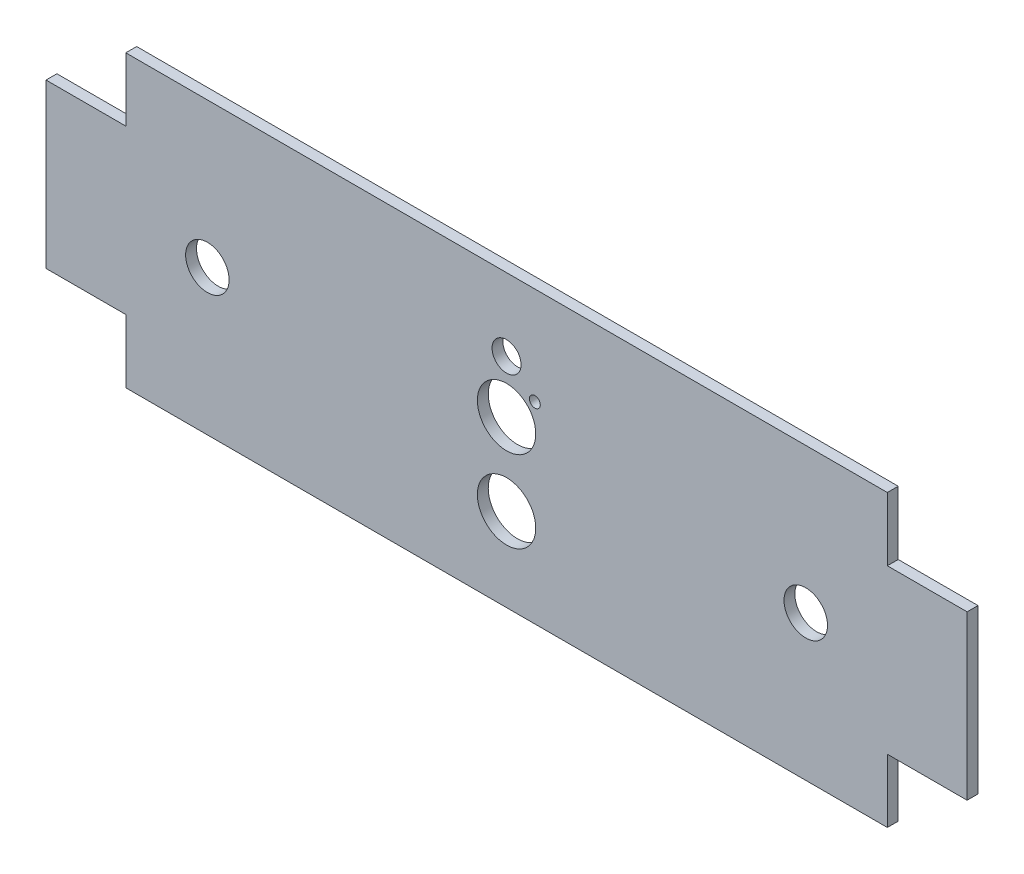
ISO-10303-21;
HEADER;
FILE_DESCRIPTION(('STEP AP214'),'2;1');
FILE_NAME('part.step','',(''),(''),'','','');
FILE_SCHEMA(('AUTOMOTIVE_DESIGN { 1 0 10303 214 1 1 1 1 }'));
ENDSEC;
DATA;
#1=APPLICATION_CONTEXT('core data for automotive mechanical design processes');
#2=APPLICATION_PROTOCOL_DEFINITION('international standard','automotive_design',2000,#1);
#3=PRODUCT_CONTEXT('',#1,'mechanical');
#4=PRODUCT('Part','Part','',(#3));
#5=PRODUCT_RELATED_PRODUCT_CATEGORY('part','',(#4));
#6=PRODUCT_DEFINITION_FORMATION('','',#4);
#7=PRODUCT_DEFINITION_CONTEXT('part definition',#1,'design');
#8=PRODUCT_DEFINITION('design','',#6,#7);
#9=PRODUCT_DEFINITION_SHAPE('','',#8);
#10=(LENGTH_UNIT() NAMED_UNIT(*) SI_UNIT(.MILLI.,.METRE.));
#11=(NAMED_UNIT(*) PLANE_ANGLE_UNIT() SI_UNIT($,.RADIAN.));
#12=(NAMED_UNIT(*) SI_UNIT($,.STERADIAN.) SOLID_ANGLE_UNIT());
#13=UNCERTAINTY_MEASURE_WITH_UNIT(LENGTH_MEASURE(1.E-05),#10,'distance_accuracy_value','');
#14=(GEOMETRIC_REPRESENTATION_CONTEXT(3) GLOBAL_UNCERTAINTY_ASSIGNED_CONTEXT((#13)) GLOBAL_UNIT_ASSIGNED_CONTEXT((#10,
#11,#12)) REPRESENTATION_CONTEXT('',''));
#15=CARTESIAN_POINT('',(0.,0.,0.));
#16=DIRECTION('',(0.,0.,1.));
#17=DIRECTION('',(1.,0.,0.));
#18=AXIS2_PLACEMENT_3D('',#15,#16,#17);
#19=CARTESIAN_POINT('',(-105.,-203.144327739373,3.));
#20=DIRECTION('',(-1.,0.,0.));
#21=DIRECTION('',(0.,0.,1.));
#22=AXIS2_PLACEMENT_3D('',#19,#20,#21);
#23=PLANE('',#22);
#24=DIRECTION('',(0.,1.,0.));
#25=VECTOR('',#24,1.);
#26=CARTESIAN_POINT('',(-105.,-203.144327739373,0.));
#27=LINE('',#26,#25);
#28=CARTESIAN_POINT('',(-105.,22.5,0.));
#29=VERTEX_POINT('',#28);
#30=CARTESIAN_POINT('',(-105.,40.,0.));
#31=VERTEX_POINT('',#30);
#32=EDGE_CURVE('E176',#29,#31,#27,.T.);
#33=ORIENTED_EDGE('',*,*,#32,.F.);
#34=DIRECTION('',(0.,0.,-1.));
#35=VECTOR('',#34,1.);
#36=CARTESIAN_POINT('',(-105.,22.5,3.));
#37=LINE('',#36,#35);
#38=CARTESIAN_POINT('',(-105.,22.5,3.));
#39=VERTEX_POINT('',#38);
#40=EDGE_CURVE('E189',#39,#29,#37,.T.);
#41=ORIENTED_EDGE('',*,*,#40,.F.);
#42=DIRECTION('',(0.,1.,0.));
#43=VECTOR('',#42,1.);
#44=CARTESIAN_POINT('',(-105.,-203.144327739373,3.));
#45=LINE('',#44,#43);
#46=CARTESIAN_POINT('',(-105.,40.,3.));
#47=VERTEX_POINT('',#46);
#48=EDGE_CURVE('E193',#39,#47,#45,.T.);
#49=ORIENTED_EDGE('',*,*,#48,.T.);
#50=DIRECTION('',(0.,0.,1.));
#51=VECTOR('',#50,1.);
#52=CARTESIAN_POINT('',(-105.,40.,-210.237960416286));
#53=LINE('',#52,#51);
#54=EDGE_CURVE('E265',#31,#47,#53,.T.);
#55=ORIENTED_EDGE('',*,*,#54,.F.);
#56=EDGE_LOOP('',(#33,#41,#49,#55));
#57=FACE_BOUND('',#56,.T.);
#58=ADVANCED_FACE('F69',(#57),#23,.T.);
#59=CARTESIAN_POINT('',(-105.,-40.,0.));
#60=VERTEX_POINT('',#59);
#61=CARTESIAN_POINT('',(-105.,-22.5,0.));
#62=VERTEX_POINT('',#61);
#63=EDGE_CURVE('E116',#60,#62,#27,.T.);
#64=ORIENTED_EDGE('',*,*,#63,.F.);
#65=DIRECTION('',(0.,0.,1.));
#66=VECTOR('',#65,1.);
#67=CARTESIAN_POINT('',(-105.,-40.,-210.237960416286));
#68=LINE('',#67,#66);
#69=CARTESIAN_POINT('',(-105.,-40.,3.));
#70=VERTEX_POINT('',#69);
#71=EDGE_CURVE('E274',#60,#70,#68,.T.);
#72=ORIENTED_EDGE('',*,*,#71,.T.);
#73=CARTESIAN_POINT('',(-105.,-22.5,3.));
#74=VERTEX_POINT('',#73);
#75=EDGE_CURVE('E217',#70,#74,#45,.T.);
#76=ORIENTED_EDGE('',*,*,#75,.T.);
#77=DIRECTION('',(0.,0.,-1.));
#78=VECTOR('',#77,1.);
#79=CARTESIAN_POINT('',(-105.,-22.5,3.));
#80=LINE('',#79,#78);
#81=EDGE_CURVE('E192',#74,#62,#80,.T.);
#82=ORIENTED_EDGE('',*,*,#81,.T.);
#83=EDGE_LOOP('',(#64,#72,#76,#82));
#84=FACE_BOUND('',#83,.T.);
#85=ADVANCED_FACE('F340',(#84),#23,.T.);
#86=CARTESIAN_POINT('',(0.,-22.5,3.));
#87=DIRECTION('',(0.,1.,0.));
#88=DIRECTION('',(0.,0.,1.));
#89=AXIS2_PLACEMENT_3D('',#86,#87,#88);
#90=PLANE('',#89);
#91=DIRECTION('',(1.,0.,0.));
#92=VECTOR('',#91,1.);
#93=CARTESIAN_POINT('',(0.,-22.5,0.));
#94=LINE('',#93,#92);
#95=CARTESIAN_POINT('',(-127.,-22.5,0.));
#96=VERTEX_POINT('',#95);
#97=EDGE_CURVE('E178',#96,#62,#94,.T.);
#98=ORIENTED_EDGE('',*,*,#97,.T.);
#99=ORIENTED_EDGE('',*,*,#81,.F.);
#100=DIRECTION('',(1.,0.,0.));
#101=VECTOR('',#100,1.);
#102=CARTESIAN_POINT('',(0.,-22.5,3.));
#103=LINE('',#102,#101);
#104=CARTESIAN_POINT('',(-127.,-22.5,3.));
#105=VERTEX_POINT('',#104);
#106=EDGE_CURVE('E300',#105,#74,#103,.T.);
#107=ORIENTED_EDGE('',*,*,#106,.F.);
#108=DIRECTION('',(0.,0.,-1.));
#109=VECTOR('',#108,1.);
#110=CARTESIAN_POINT('',(-127.,-22.5,3.));
#111=LINE('',#110,#109);
#112=EDGE_CURVE('E195',#105,#96,#111,.T.);
#113=ORIENTED_EDGE('',*,*,#112,.T.);
#114=EDGE_LOOP('',(#98,#99,#107,#113));
#115=FACE_BOUND('',#114,.T.);
#116=ADVANCED_FACE('F342',(#115),#90,.F.);
#117=CARTESIAN_POINT('',(-127.,-203.144327739373,3.));
#118=DIRECTION('',(-1.,0.,0.));
#119=DIRECTION('',(0.,0.,1.));
#120=AXIS2_PLACEMENT_3D('',#117,#118,#119);
#121=PLANE('',#120);
#122=DIRECTION('',(0.,1.,0.));
#123=VECTOR('',#122,1.);
#124=CARTESIAN_POINT('',(-127.,-203.144327739373,0.));
#125=LINE('',#124,#123);
#126=CARTESIAN_POINT('',(-127.,22.5,0.));
#127=VERTEX_POINT('',#126);
#128=EDGE_CURVE('E202',#96,#127,#125,.T.);
#129=ORIENTED_EDGE('',*,*,#128,.F.);
#130=ORIENTED_EDGE('',*,*,#112,.F.);
#131=DIRECTION('',(0.,1.,0.));
#132=VECTOR('',#131,1.);
#133=CARTESIAN_POINT('',(-127.,-203.144327739373,3.));
#134=LINE('',#133,#132);
#135=CARTESIAN_POINT('',(-127.,22.5,3.));
#136=VERTEX_POINT('',#135);
#137=EDGE_CURVE('E204',#105,#136,#134,.T.);
#138=ORIENTED_EDGE('',*,*,#137,.T.);
#139=DIRECTION('',(0.,0.,-1.));
#140=VECTOR('',#139,1.);
#141=CARTESIAN_POINT('',(-127.,22.5,3.));
#142=LINE('',#141,#140);
#143=EDGE_CURVE('E157',#136,#127,#142,.T.);
#144=ORIENTED_EDGE('',*,*,#143,.T.);
#145=EDGE_LOOP('',(#129,#130,#138,#144));
#146=FACE_BOUND('',#145,.T.);
#147=ADVANCED_FACE('F200',(#146),#121,.T.);
#148=CARTESIAN_POINT('',(0.,22.5,3.));
#149=DIRECTION('',(0.,1.,0.));
#150=DIRECTION('',(0.,0.,1.));
#151=AXIS2_PLACEMENT_3D('',#148,#149,#150);
#152=PLANE('',#151);
#153=DIRECTION('',(1.,0.,0.));
#154=VECTOR('',#153,1.);
#155=CARTESIAN_POINT('',(0.,22.5,0.));
#156=LINE('',#155,#154);
#157=EDGE_CURVE('E208',#127,#29,#156,.T.);
#158=ORIENTED_EDGE('',*,*,#157,.F.);
#159=ORIENTED_EDGE('',*,*,#143,.F.);
#160=DIRECTION('',(1.,0.,0.));
#161=VECTOR('',#160,1.);
#162=CARTESIAN_POINT('',(0.,22.5,3.));
#163=LINE('',#162,#161);
#164=EDGE_CURVE('E298',#136,#39,#163,.T.);
#165=ORIENTED_EDGE('',*,*,#164,.T.);
#166=ORIENTED_EDGE('',*,*,#40,.T.);
#167=EDGE_LOOP('',(#158,#159,#165,#166));
#168=FACE_BOUND('',#167,.T.);
#169=ADVANCED_FACE('F209',(#168),#152,.T.);
#170=CARTESIAN_POINT('',(0.,-203.144327739373,0.));
#171=DIRECTION('',(0.,0.,1.));
#172=DIRECTION('',(1.,0.,0.));
#173=AXIS2_PLACEMENT_3D('',#170,#171,#172);
#174=PLANE('',#173);
#175=CARTESIAN_POINT('',(0.,-17.,0.));
#176=DIRECTION('',(0.,0.,-1.));
#177=DIRECTION('',(-1.,0.,0.));
#178=AXIS2_PLACEMENT_3D('',#175,#176,#177);
#179=CIRCLE('',#178,8.05);
#180=CARTESIAN_POINT('',(-8.05000000000001,-17.,0.));
#181=VERTEX_POINT('',#180);
#182=EDGE_CURVE('E260',#181,#181,#179,.T.);
#183=ORIENTED_EDGE('',*,*,#182,.F.);
#184=EDGE_LOOP('',(#183));
#185=FACE_BOUND('',#184,.T.);
#186=CARTESIAN_POINT('',(0.,5.5,0.));
#187=DIRECTION('',(0.,0.,-1.));
#188=DIRECTION('',(-1.,0.,0.));
#189=AXIS2_PLACEMENT_3D('',#186,#187,#188);
#190=CIRCLE('',#189,8.05);
#191=CARTESIAN_POINT('',(-8.05,5.5,0.));
#192=VERTEX_POINT('',#191);
#193=EDGE_CURVE('E250',#192,#192,#190,.T.);
#194=ORIENTED_EDGE('',*,*,#193,.F.);
#195=EDGE_LOOP('',(#194));
#196=FACE_BOUND('',#195,.T.);
#197=CARTESIAN_POINT('',(7.8,13.05,0.));
#198=DIRECTION('',(0.,0.,-1.));
#199=DIRECTION('',(-1.,0.,0.));
#200=AXIS2_PLACEMENT_3D('',#197,#198,#199);
#201=CIRCLE('',#200,1.5);
#202=CARTESIAN_POINT('',(6.29999999999999,13.05,0.));
#203=VERTEX_POINT('',#202);
#204=EDGE_CURVE('E247',#203,#203,#201,.T.);
#205=ORIENTED_EDGE('',*,*,#204,.F.);
#206=EDGE_LOOP('',(#205));
#207=FACE_BOUND('',#206,.T.);
#208=CARTESIAN_POINT('',(0.,20.,0.));
#209=DIRECTION('',(0.,0.,1.));
#210=DIRECTION('',(1.,0.,0.));
#211=AXIS2_PLACEMENT_3D('',#208,#209,#210);
#212=CIRCLE('',#211,4.);
#213=CARTESIAN_POINT('',(4.,20.,0.));
#214=VERTEX_POINT('',#213);
#215=EDGE_CURVE('E284',#214,#214,#212,.F.);
#216=ORIENTED_EDGE('',*,*,#215,.F.);
#217=EDGE_LOOP('',(#216));
#218=FACE_BOUND('',#217,.T.);
#219=CARTESIAN_POINT('',(-82.5,0.,0.));
#220=DIRECTION('',(0.,0.,1.));
#221=DIRECTION('',(1.,0.,0.));
#222=AXIS2_PLACEMENT_3D('',#219,#220,#221);
#223=CIRCLE('',#222,6.);
#224=CARTESIAN_POINT('',(-76.5,0.,0.));
#225=VERTEX_POINT('',#224);
#226=EDGE_CURVE('E290',#225,#225,#223,.F.);
#227=ORIENTED_EDGE('',*,*,#226,.F.);
#228=EDGE_LOOP('',(#227));
#229=FACE_BOUND('',#228,.T.);
#230=CARTESIAN_POINT('',(82.5,0.,0.));
#231=DIRECTION('',(0.,0.,1.));
#232=DIRECTION('',(1.,0.,0.));
#233=AXIS2_PLACEMENT_3D('',#230,#231,#232);
#234=CIRCLE('',#233,6.);
#235=CARTESIAN_POINT('',(88.5,0.,0.));
#236=VERTEX_POINT('',#235);
#237=EDGE_CURVE('E165',#236,#236,#234,.F.);
#238=ORIENTED_EDGE('',*,*,#237,.F.);
#239=EDGE_LOOP('',(#238));
#240=FACE_BOUND('',#239,.T.);
#241=ORIENTED_EDGE('',*,*,#157,.T.);
#242=ORIENTED_EDGE('',*,*,#32,.T.);
#243=DIRECTION('',(1.,0.,0.));
#244=VECTOR('',#243,1.);
#245=CARTESIAN_POINT('',(-105.,40.,0.));
#246=LINE('',#245,#244);
#247=CARTESIAN_POINT('',(105.,40.,0.));
#248=VERTEX_POINT('',#247);
#249=EDGE_CURVE('E171',#31,#248,#246,.T.);
#250=ORIENTED_EDGE('',*,*,#249,.T.);
#251=DIRECTION('',(0.,1.,0.));
#252=VECTOR('',#251,1.);
#253=CARTESIAN_POINT('',(105.,-203.144327739373,0.));
#254=LINE('',#253,#252);
#255=CARTESIAN_POINT('',(105.,22.5,0.));
#256=VERTEX_POINT('',#255);
#257=EDGE_CURVE('E153',#256,#248,#254,.T.);
#258=ORIENTED_EDGE('',*,*,#257,.F.);
#259=DIRECTION('',(-1.,0.,0.));
#260=VECTOR('',#259,1.);
#261=CARTESIAN_POINT('',(127.,22.5,0.));
#262=LINE('',#261,#260);
#263=CARTESIAN_POINT('',(127.,22.5,0.));
#264=VERTEX_POINT('',#263);
#265=EDGE_CURVE('E160',#264,#256,#262,.T.);
#266=ORIENTED_EDGE('',*,*,#265,.F.);
#267=DIRECTION('',(0.,-1.,0.));
#268=VECTOR('',#267,1.);
#269=CARTESIAN_POINT('',(127.,22.5,0.));
#270=LINE('',#269,#268);
#271=CARTESIAN_POINT('',(127.,-22.5,0.));
#272=VERTEX_POINT('',#271);
#273=EDGE_CURVE('E230',#264,#272,#270,.T.);
#274=ORIENTED_EDGE('',*,*,#273,.T.);
#275=DIRECTION('',(-1.,0.,0.));
#276=VECTOR('',#275,1.);
#277=CARTESIAN_POINT('',(127.,-22.5,0.));
#278=LINE('',#277,#276);
#279=CARTESIAN_POINT('',(105.,-22.5,0.));
#280=VERTEX_POINT('',#279);
#281=EDGE_CURVE('E164',#272,#280,#278,.T.);
#282=ORIENTED_EDGE('',*,*,#281,.T.);
#283=CARTESIAN_POINT('',(105.,-40.,0.));
#284=VERTEX_POINT('',#283);
#285=EDGE_CURVE('E173',#284,#280,#254,.T.);
#286=ORIENTED_EDGE('',*,*,#285,.F.);
#287=DIRECTION('',(-1.,0.,0.));
#288=VECTOR('',#287,1.);
#289=CARTESIAN_POINT('',(-105.,-40.,0.));
#290=LINE('',#289,#288);
#291=EDGE_CURVE('E278',#284,#60,#290,.T.);
#292=ORIENTED_EDGE('',*,*,#291,.T.);
#293=ORIENTED_EDGE('',*,*,#63,.T.);
#294=ORIENTED_EDGE('',*,*,#97,.F.);
#295=ORIENTED_EDGE('',*,*,#128,.T.);
#296=EDGE_LOOP('',(#241,#242,#250,#258,#266,#274,#282,#286,#292,#293,#294,#295));
#297=FACE_BOUND('',#296,.T.);
#298=ADVANCED_FACE('F168',(#185,#196,#207,#218,#229,#240,#297),#174,.F.);
#299=CARTESIAN_POINT('',(0.,-203.144327739373,3.));
#300=DIRECTION('',(0.,0.,1.));
#301=DIRECTION('',(1.,0.,0.));
#302=AXIS2_PLACEMENT_3D('',#299,#300,#301);
#303=PLANE('',#302);
#304=CARTESIAN_POINT('',(0.,-17.,3.));
#305=DIRECTION('',(0.,0.,1.));
#306=DIRECTION('',(1.,0.,0.));
#307=AXIS2_PLACEMENT_3D('',#304,#305,#306);
#308=CIRCLE('',#307,8.05);
#309=CARTESIAN_POINT('',(8.05,-17.,3.));
#310=VERTEX_POINT('',#309);
#311=EDGE_CURVE('E73',#310,#310,#308,.T.);
#312=ORIENTED_EDGE('',*,*,#311,.F.);
#313=EDGE_LOOP('',(#312));
#314=FACE_BOUND('',#313,.T.);
#315=CARTESIAN_POINT('',(0.,5.5,3.));
#316=DIRECTION('',(0.,0.,1.));
#317=DIRECTION('',(1.,0.,0.));
#318=AXIS2_PLACEMENT_3D('',#315,#316,#317);
#319=CIRCLE('',#318,8.05);
#320=CARTESIAN_POINT('',(8.05,5.5,3.));
#321=VERTEX_POINT('',#320);
#322=EDGE_CURVE('E248',#321,#321,#319,.T.);
#323=ORIENTED_EDGE('',*,*,#322,.F.);
#324=EDGE_LOOP('',(#323));
#325=FACE_BOUND('',#324,.T.);
#326=CARTESIAN_POINT('',(7.8,13.05,3.));
#327=DIRECTION('',(0.,0.,1.));
#328=DIRECTION('',(1.,0.,0.));
#329=AXIS2_PLACEMENT_3D('',#326,#327,#328);
#330=CIRCLE('',#329,1.5);
#331=CARTESIAN_POINT('',(9.3,13.05,3.));
#332=VERTEX_POINT('',#331);
#333=EDGE_CURVE('E244',#332,#332,#330,.T.);
#334=ORIENTED_EDGE('',*,*,#333,.F.);
#335=EDGE_LOOP('',(#334));
#336=FACE_BOUND('',#335,.T.);
#337=CARTESIAN_POINT('',(0.,20.,3.));
#338=DIRECTION('',(0.,0.,1.));
#339=DIRECTION('',(1.,0.,0.));
#340=AXIS2_PLACEMENT_3D('',#337,#338,#339);
#341=CIRCLE('',#340,4.);
#342=CARTESIAN_POINT('',(4.,20.,3.));
#343=VERTEX_POINT('',#342);
#344=EDGE_CURVE('E281',#343,#343,#341,.T.);
#345=ORIENTED_EDGE('',*,*,#344,.F.);
#346=EDGE_LOOP('',(#345));
#347=FACE_BOUND('',#346,.T.);
#348=CARTESIAN_POINT('',(-82.5,0.,3.));
#349=DIRECTION('',(0.,0.,1.));
#350=DIRECTION('',(1.,0.,0.));
#351=AXIS2_PLACEMENT_3D('',#348,#349,#350);
#352=CIRCLE('',#351,6.);
#353=CARTESIAN_POINT('',(-76.5,0.,3.));
#354=VERTEX_POINT('',#353);
#355=EDGE_CURVE('E287',#354,#354,#352,.T.);
#356=ORIENTED_EDGE('',*,*,#355,.F.);
#357=EDGE_LOOP('',(#356));
#358=FACE_BOUND('',#357,.T.);
#359=CARTESIAN_POINT('',(82.5,0.,3.));
#360=DIRECTION('',(0.,0.,1.));
#361=DIRECTION('',(1.,0.,0.));
#362=AXIS2_PLACEMENT_3D('',#359,#360,#361);
#363=CIRCLE('',#362,6.);
#364=CARTESIAN_POINT('',(88.5,0.,3.));
#365=VERTEX_POINT('',#364);
#366=EDGE_CURVE('E293',#365,#365,#363,.T.);
#367=ORIENTED_EDGE('',*,*,#366,.F.);
#368=EDGE_LOOP('',(#367));
#369=FACE_BOUND('',#368,.T.);
#370=ORIENTED_EDGE('',*,*,#164,.F.);
#371=ORIENTED_EDGE('',*,*,#137,.F.);
#372=ORIENTED_EDGE('',*,*,#106,.T.);
#373=ORIENTED_EDGE('',*,*,#75,.F.);
#374=DIRECTION('',(1.,0.,0.));
#375=VECTOR('',#374,1.);
#376=CARTESIAN_POINT('',(-105.,-40.,3.));
#377=LINE('',#376,#375);
#378=CARTESIAN_POINT('',(105.,-40.,3.));
#379=VERTEX_POINT('',#378);
#380=EDGE_CURVE('E264',#70,#379,#377,.T.);
#381=ORIENTED_EDGE('',*,*,#380,.T.);
#382=DIRECTION('',(0.,1.,0.));
#383=VECTOR('',#382,1.);
#384=CARTESIAN_POINT('',(105.,-203.144327739373,3.));
#385=LINE('',#384,#383);
#386=CARTESIAN_POINT('',(105.,-22.5,3.));
#387=VERTEX_POINT('',#386);
#388=EDGE_CURVE('E183',#379,#387,#385,.T.);
#389=ORIENTED_EDGE('',*,*,#388,.T.);
#390=DIRECTION('',(-1.,0.,0.));
#391=VECTOR('',#390,1.);
#392=CARTESIAN_POINT('',(127.,-22.5,3.));
#393=LINE('',#392,#391);
#394=CARTESIAN_POINT('',(127.,-22.5,3.));
#395=VERTEX_POINT('',#394);
#396=EDGE_CURVE('E229',#395,#387,#393,.T.);
#397=ORIENTED_EDGE('',*,*,#396,.F.);
#398=DIRECTION('',(0.,-1.,0.));
#399=VECTOR('',#398,1.);
#400=CARTESIAN_POINT('',(127.,22.5,3.));
#401=LINE('',#400,#399);
#402=CARTESIAN_POINT('',(127.,22.5,3.));
#403=VERTEX_POINT('',#402);
#404=EDGE_CURVE('E237',#403,#395,#401,.T.);
#405=ORIENTED_EDGE('',*,*,#404,.F.);
#406=DIRECTION('',(-1.,0.,0.));
#407=VECTOR('',#406,1.);
#408=CARTESIAN_POINT('',(127.,22.5,3.));
#409=LINE('',#408,#407);
#410=CARTESIAN_POINT('',(105.,22.5,3.));
#411=VERTEX_POINT('',#410);
#412=EDGE_CURVE('E227',#403,#411,#409,.T.);
#413=ORIENTED_EDGE('',*,*,#412,.T.);
#414=CARTESIAN_POINT('',(105.,40.,3.));
#415=VERTEX_POINT('',#414);
#416=EDGE_CURVE('E156',#411,#415,#385,.T.);
#417=ORIENTED_EDGE('',*,*,#416,.T.);
#418=DIRECTION('',(-1.,0.,0.));
#419=VECTOR('',#418,1.);
#420=CARTESIAN_POINT('',(-105.,40.,3.));
#421=LINE('',#420,#419);
#422=EDGE_CURVE('E246',#415,#47,#421,.T.);
#423=ORIENTED_EDGE('',*,*,#422,.T.);
#424=ORIENTED_EDGE('',*,*,#48,.F.);
#425=EDGE_LOOP('',(#370,#371,#372,#373,#381,#389,#397,#405,#413,#417,#423,#424));
#426=FACE_BOUND('',#425,.T.);
#427=ADVANCED_FACE('F314',(#314,#325,#336,#347,#358,#369,#426),#303,.T.);
#428=CARTESIAN_POINT('',(105.,-203.144327739373,3.));
#429=DIRECTION('',(-1.,0.,0.));
#430=DIRECTION('',(0.,0.,1.));
#431=AXIS2_PLACEMENT_3D('',#428,#429,#430);
#432=PLANE('',#431);
#433=ORIENTED_EDGE('',*,*,#416,.F.);
#434=DIRECTION('',(0.,0.,-1.));
#435=VECTOR('',#434,1.);
#436=CARTESIAN_POINT('',(105.,22.5,3.));
#437=LINE('',#436,#435);
#438=EDGE_CURVE('E79',#411,#256,#437,.T.);
#439=ORIENTED_EDGE('',*,*,#438,.T.);
#440=ORIENTED_EDGE('',*,*,#257,.T.);
#441=DIRECTION('',(0.,0.,1.));
#442=VECTOR('',#441,1.);
#443=CARTESIAN_POINT('',(105.,40.,-210.237960416286));
#444=LINE('',#443,#442);
#445=EDGE_CURVE('E268',#248,#415,#444,.T.);
#446=ORIENTED_EDGE('',*,*,#445,.T.);
#447=EDGE_LOOP('',(#433,#439,#440,#446));
#448=FACE_BOUND('',#447,.T.);
#449=ADVANCED_FACE('F149',(#448),#432,.F.);
#450=DIRECTION('',(0.,0.,-1.));
#451=VECTOR('',#450,1.);
#452=CARTESIAN_POINT('',(105.,-22.5,3.));
#453=LINE('',#452,#451);
#454=EDGE_CURVE('E12',#387,#280,#453,.T.);
#455=ORIENTED_EDGE('',*,*,#454,.F.);
#456=ORIENTED_EDGE('',*,*,#388,.F.);
#457=DIRECTION('',(0.,0.,1.));
#458=VECTOR('',#457,1.);
#459=CARTESIAN_POINT('',(105.,-40.,-210.237960416286));
#460=LINE('',#459,#458);
#461=EDGE_CURVE('E275',#284,#379,#460,.T.);
#462=ORIENTED_EDGE('',*,*,#461,.F.);
#463=ORIENTED_EDGE('',*,*,#285,.T.);
#464=EDGE_LOOP('',(#455,#456,#462,#463));
#465=FACE_BOUND('',#464,.T.);
#466=ADVANCED_FACE('F319',(#465),#432,.F.);
#467=CARTESIAN_POINT('',(127.,22.5,3.));
#468=DIRECTION('',(1.,0.,0.));
#469=DIRECTION('',(0.,0.,-1.));
#470=AXIS2_PLACEMENT_3D('',#467,#468,#469);
#471=PLANE('',#470);
#472=ORIENTED_EDGE('',*,*,#273,.F.);
#473=DIRECTION('',(0.,0.,-1.));
#474=VECTOR('',#473,1.);
#475=CARTESIAN_POINT('',(127.,22.5,3.));
#476=LINE('',#475,#474);
#477=EDGE_CURVE('E161',#403,#264,#476,.T.);
#478=ORIENTED_EDGE('',*,*,#477,.F.);
#479=ORIENTED_EDGE('',*,*,#404,.T.);
#480=DIRECTION('',(0.,0.,-1.));
#481=VECTOR('',#480,1.);
#482=CARTESIAN_POINT('',(127.,-22.5,3.));
#483=LINE('',#482,#481);
#484=EDGE_CURVE('E106',#395,#272,#483,.T.);
#485=ORIENTED_EDGE('',*,*,#484,.T.);
#486=EDGE_LOOP('',(#472,#478,#479,#485));
#487=FACE_BOUND('',#486,.T.);
#488=ADVANCED_FACE('F329',(#487),#471,.T.);
#489=CARTESIAN_POINT('',(127.,22.5,3.));
#490=DIRECTION('',(0.,-1.,0.));
#491=DIRECTION('',(1.,0.,0.));
#492=AXIS2_PLACEMENT_3D('',#489,#490,#491);
#493=PLANE('',#492);
#494=ORIENTED_EDGE('',*,*,#265,.T.);
#495=ORIENTED_EDGE('',*,*,#438,.F.);
#496=ORIENTED_EDGE('',*,*,#412,.F.);
#497=ORIENTED_EDGE('',*,*,#477,.T.);
#498=EDGE_LOOP('',(#494,#495,#496,#497));
#499=FACE_BOUND('',#498,.T.);
#500=ADVANCED_FACE('F71',(#499),#493,.F.);
#501=CARTESIAN_POINT('',(127.,-22.5,3.));
#502=DIRECTION('',(0.,-1.,0.));
#503=DIRECTION('',(0.,0.,-1.));
#504=AXIS2_PLACEMENT_3D('',#501,#502,#503);
#505=PLANE('',#504);
#506=ORIENTED_EDGE('',*,*,#281,.F.);
#507=ORIENTED_EDGE('',*,*,#484,.F.);
#508=ORIENTED_EDGE('',*,*,#396,.T.);
#509=ORIENTED_EDGE('',*,*,#454,.T.);
#510=EDGE_LOOP('',(#506,#507,#508,#509));
#511=FACE_BOUND('',#510,.T.);
#512=ADVANCED_FACE('F326',(#511),#505,.T.);
#513=CARTESIAN_POINT('',(82.5,0.,-0.00104999999999984));
#514=DIRECTION('',(0.,0.,1.));
#515=DIRECTION('',(1.,0.,0.));
#516=AXIS2_PLACEMENT_3D('',#513,#514,#515);
#517=CYLINDRICAL_SURFACE('',#516,6.);
#518=ORIENTED_EDGE('',*,*,#366,.T.);
#519=EDGE_LOOP('',(#518));
#520=FACE_BOUND('',#519,.T.);
#521=ORIENTED_EDGE('',*,*,#237,.T.);
#522=EDGE_LOOP('',(#521));
#523=FACE_BOUND('',#522,.T.);
#524=ADVANCED_FACE('F360',(#520,#523),#517,.F.);
#525=CARTESIAN_POINT('',(-82.5,0.,-0.00104999999999984));
#526=DIRECTION('',(0.,0.,1.));
#527=DIRECTION('',(1.,0.,0.));
#528=AXIS2_PLACEMENT_3D('',#525,#526,#527);
#529=CYLINDRICAL_SURFACE('',#528,6.);
#530=ORIENTED_EDGE('',*,*,#355,.T.);
#531=EDGE_LOOP('',(#530));
#532=FACE_BOUND('',#531,.T.);
#533=ORIENTED_EDGE('',*,*,#226,.T.);
#534=EDGE_LOOP('',(#533));
#535=FACE_BOUND('',#534,.T.);
#536=ADVANCED_FACE('F366',(#532,#535),#529,.F.);
#537=CARTESIAN_POINT('',(0.,20.,-0.00104999999999984));
#538=DIRECTION('',(0.,0.,1.));
#539=DIRECTION('',(1.,0.,0.));
#540=AXIS2_PLACEMENT_3D('',#537,#538,#539);
#541=CYLINDRICAL_SURFACE('',#540,4.);
#542=ORIENTED_EDGE('',*,*,#344,.T.);
#543=EDGE_LOOP('',(#542));
#544=FACE_BOUND('',#543,.T.);
#545=ORIENTED_EDGE('',*,*,#215,.T.);
#546=EDGE_LOOP('',(#545));
#547=FACE_BOUND('',#546,.T.);
#548=ADVANCED_FACE('F410',(#544,#547),#541,.F.);
#549=CARTESIAN_POINT('',(-105.,-40.,-210.237960416286));
#550=DIRECTION('',(0.,-1.,0.));
#551=DIRECTION('',(0.,0.,-1.));
#552=AXIS2_PLACEMENT_3D('',#549,#550,#551);
#553=PLANE('',#552);
#554=ORIENTED_EDGE('',*,*,#291,.F.);
#555=ORIENTED_EDGE('',*,*,#461,.T.);
#556=ORIENTED_EDGE('',*,*,#380,.F.);
#557=ORIENTED_EDGE('',*,*,#71,.F.);
#558=EDGE_LOOP('',(#554,#555,#556,#557));
#559=FACE_BOUND('',#558,.T.);
#560=ADVANCED_FACE('F323',(#559),#553,.T.);
#561=CARTESIAN_POINT('',(-105.,40.,-210.237960416286));
#562=DIRECTION('',(0.,1.,0.));
#563=DIRECTION('',(0.,0.,1.));
#564=AXIS2_PLACEMENT_3D('',#561,#562,#563);
#565=PLANE('',#564);
#566=ORIENTED_EDGE('',*,*,#249,.F.);
#567=ORIENTED_EDGE('',*,*,#54,.T.);
#568=ORIENTED_EDGE('',*,*,#422,.F.);
#569=ORIENTED_EDGE('',*,*,#445,.F.);
#570=EDGE_LOOP('',(#566,#567,#568,#569));
#571=FACE_BOUND('',#570,.T.);
#572=ADVANCED_FACE('F334',(#571),#565,.T.);
#573=CARTESIAN_POINT('',(7.8,13.05,7.));
#574=DIRECTION('',(0.,0.,-1.));
#575=DIRECTION('',(-1.,0.,0.));
#576=AXIS2_PLACEMENT_3D('',#573,#574,#575);
#577=CYLINDRICAL_SURFACE('',#576,1.5);
#578=ORIENTED_EDGE('',*,*,#333,.T.);
#579=EDGE_LOOP('',(#578));
#580=FACE_BOUND('',#579,.T.);
#581=ORIENTED_EDGE('',*,*,#204,.T.);
#582=EDGE_LOOP('',(#581));
#583=FACE_BOUND('',#582,.T.);
#584=ADVANCED_FACE('F489',(#580,#583),#577,.F.);
#585=CARTESIAN_POINT('',(0.,5.5,7.));
#586=DIRECTION('',(0.,0.,-1.));
#587=DIRECTION('',(-1.,0.,0.));
#588=AXIS2_PLACEMENT_3D('',#585,#586,#587);
#589=CYLINDRICAL_SURFACE('',#588,8.05);
#590=ORIENTED_EDGE('',*,*,#322,.T.);
#591=EDGE_LOOP('',(#590));
#592=FACE_BOUND('',#591,.T.);
#593=ORIENTED_EDGE('',*,*,#193,.T.);
#594=EDGE_LOOP('',(#593));
#595=FACE_BOUND('',#594,.T.);
#596=ADVANCED_FACE('F503',(#592,#595),#589,.F.);
#597=CARTESIAN_POINT('',(0.,-17.,7.));
#598=DIRECTION('',(0.,0.,-1.));
#599=DIRECTION('',(-1.,0.,0.));
#600=AXIS2_PLACEMENT_3D('',#597,#598,#599);
#601=CYLINDRICAL_SURFACE('',#600,8.05);
#602=ORIENTED_EDGE('',*,*,#311,.T.);
#603=EDGE_LOOP('',(#602));
#604=FACE_BOUND('',#603,.T.);
#605=ORIENTED_EDGE('',*,*,#182,.T.);
#606=EDGE_LOOP('',(#605));
#607=FACE_BOUND('',#606,.T.);
#608=ADVANCED_FACE('F513',(#604,#607),#601,.F.);
#609=CLOSED_SHELL('',(#58,#85,#116,#147,#169,#298,#427,#449,#466,#488,#500,#512,#524,#536,#548,
#560,#572,#584,#596,#608));
#610=MANIFOLD_SOLID_BREP('B2',#609);
#611=ADVANCED_BREP_SHAPE_REPRESENTATION('',(#18,#610),#14);
#612=SHAPE_DEFINITION_REPRESENTATION(#9,#611);
ENDSEC;
END-ISO-10303-21;
